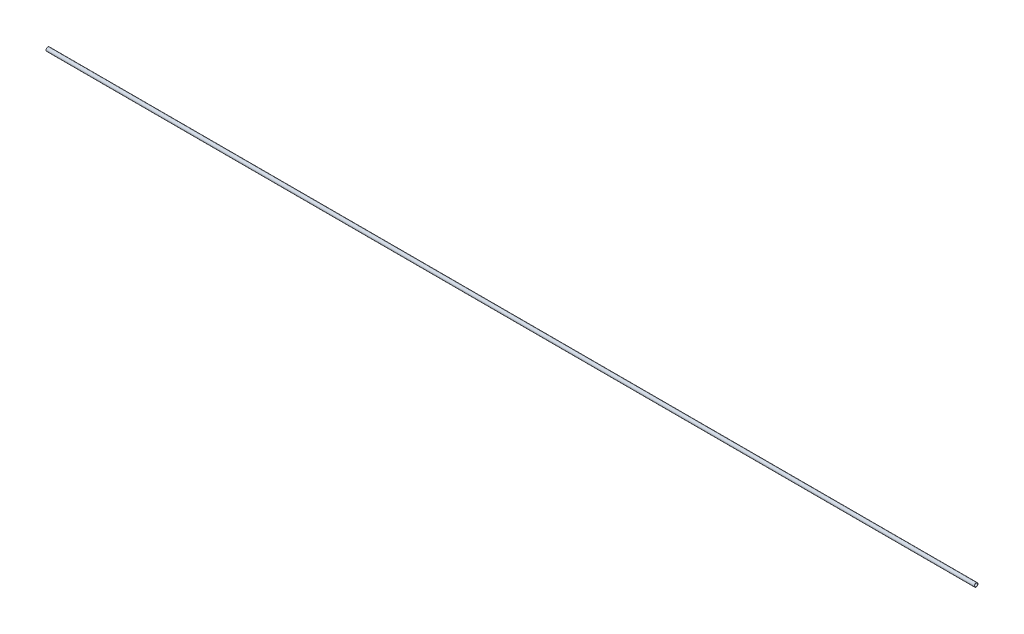
ISO-10303-21;
HEADER;
FILE_DESCRIPTION(('STEP AP214'),'2;1');
FILE_NAME('part.step','',(''),(''),'','','');
FILE_SCHEMA(('AUTOMOTIVE_DESIGN { 1 0 10303 214 1 1 1 1 }'));
ENDSEC;
DATA;
#1=APPLICATION_CONTEXT('core data for automotive mechanical design processes');
#2=APPLICATION_PROTOCOL_DEFINITION('international standard','automotive_design',2000,#1);
#3=PRODUCT_CONTEXT('',#1,'mechanical');
#4=PRODUCT('Part','Part','',(#3));
#5=PRODUCT_RELATED_PRODUCT_CATEGORY('part','',(#4));
#6=PRODUCT_DEFINITION_FORMATION('','',#4);
#7=PRODUCT_DEFINITION_CONTEXT('part definition',#1,'design');
#8=PRODUCT_DEFINITION('design','',#6,#7);
#9=PRODUCT_DEFINITION_SHAPE('','',#8);
#10=(LENGTH_UNIT() NAMED_UNIT(*) SI_UNIT(.MILLI.,.METRE.));
#11=(NAMED_UNIT(*) PLANE_ANGLE_UNIT() SI_UNIT($,.RADIAN.));
#12=(NAMED_UNIT(*) SI_UNIT($,.STERADIAN.) SOLID_ANGLE_UNIT());
#13=UNCERTAINTY_MEASURE_WITH_UNIT(LENGTH_MEASURE(1.E-05),#10,'distance_accuracy_value','');
#14=(GEOMETRIC_REPRESENTATION_CONTEXT(3) GLOBAL_UNCERTAINTY_ASSIGNED_CONTEXT((#13)) GLOBAL_UNIT_ASSIGNED_CONTEXT((#10,
#11,#12)) REPRESENTATION_CONTEXT('',''));
#15=CARTESIAN_POINT('',(0.,0.,0.));
#16=DIRECTION('',(0.,0.,1.));
#17=DIRECTION('',(1.,0.,0.));
#18=AXIS2_PLACEMENT_3D('',#15,#16,#17);
#19=CARTESIAN_POINT('',(0.,0.,0.));
#20=DIRECTION('',(1.,0.,0.));
#21=DIRECTION('',(0.,0.,-1.));
#22=AXIS2_PLACEMENT_3D('',#19,#20,#21);
#23=CYLINDRICAL_SURFACE('',#22,8.1);
#24=CARTESIAN_POINT('',(0.,0.,0.));
#25=DIRECTION('',(1.,0.,0.));
#26=DIRECTION('',(0.,0.,-1.));
#27=AXIS2_PLACEMENT_3D('',#24,#25,#26);
#28=CIRCLE('',#27,8.1);
#29=CARTESIAN_POINT('',(0.,0.,-8.1));
#30=VERTEX_POINT('',#29);
#31=EDGE_CURVE('E16',#30,#30,#28,.T.);
#32=ORIENTED_EDGE('',*,*,#31,.F.);
#33=EDGE_LOOP('',(#32));
#34=FACE_BOUND('',#33,.T.);
#35=CARTESIAN_POINT('',(5000.,0.,0.));
#36=DIRECTION('',(1.,0.,0.));
#37=DIRECTION('',(0.,0.,-1.));
#38=AXIS2_PLACEMENT_3D('',#35,#36,#37);
#39=CIRCLE('',#38,8.1);
#40=CARTESIAN_POINT('',(5000.,0.,-8.1));
#41=VERTEX_POINT('',#40);
#42=EDGE_CURVE('E25',#41,#41,#39,.F.);
#43=ORIENTED_EDGE('',*,*,#42,.F.);
#44=EDGE_LOOP('',(#43));
#45=FACE_BOUND('',#44,.T.);
#46=ADVANCED_FACE('F13',(#34,#45),#23,.F.);
#47=CARTESIAN_POINT('',(0.,-10.1200021082709,-10.));
#48=DIRECTION('',(-1.,0.,0.));
#49=DIRECTION('',(0.,0.,1.));
#50=AXIS2_PLACEMENT_3D('',#47,#48,#49);
#51=PLANE('',#50);
#52=ORIENTED_EDGE('',*,*,#31,.T.);
#53=EDGE_LOOP('',(#52));
#54=FACE_BOUND('',#53,.T.);
#55=CARTESIAN_POINT('',(0.,0.,0.));
#56=DIRECTION('',(1.,0.,0.));
#57=DIRECTION('',(0.,0.,-1.));
#58=AXIS2_PLACEMENT_3D('',#55,#56,#57);
#59=CIRCLE('',#58,10.);
#60=CARTESIAN_POINT('',(0.,0.,-10.));
#61=VERTEX_POINT('',#60);
#62=EDGE_CURVE('E20',#61,#61,#59,.T.);
#63=ORIENTED_EDGE('',*,*,#62,.F.);
#64=EDGE_LOOP('',(#63));
#65=FACE_BOUND('',#64,.T.);
#66=ADVANCED_FACE('F33',(#54,#65),#51,.T.);
#67=CARTESIAN_POINT('',(5000.,-10.1200021082709,10.));
#68=DIRECTION('',(1.,0.,0.));
#69=DIRECTION('',(0.,0.,-1.));
#70=AXIS2_PLACEMENT_3D('',#67,#68,#69);
#71=PLANE('',#70);
#72=ORIENTED_EDGE('',*,*,#42,.T.);
#73=EDGE_LOOP('',(#72));
#74=FACE_BOUND('',#73,.T.);
#75=CARTESIAN_POINT('',(5000.,0.,0.));
#76=DIRECTION('',(1.,0.,0.));
#77=DIRECTION('',(0.,0.,-1.));
#78=AXIS2_PLACEMENT_3D('',#75,#76,#77);
#79=CIRCLE('',#78,10.);
#80=CARTESIAN_POINT('',(5000.,0.,-10.));
#81=VERTEX_POINT('',#80);
#82=EDGE_CURVE('E8',#81,#81,#79,.F.);
#83=ORIENTED_EDGE('',*,*,#82,.F.);
#84=EDGE_LOOP('',(#83));
#85=FACE_BOUND('',#84,.T.);
#86=ADVANCED_FACE('F42',(#74,#85),#71,.T.);
#87=CARTESIAN_POINT('',(5000.,0.,0.));
#88=DIRECTION('',(1.,0.,0.));
#89=DIRECTION('',(0.,0.,-1.));
#90=AXIS2_PLACEMENT_3D('',#87,#88,#89);
#91=CYLINDRICAL_SURFACE('',#90,10.);
#92=ORIENTED_EDGE('',*,*,#62,.T.);
#93=EDGE_LOOP('',(#92));
#94=FACE_BOUND('',#93,.T.);
#95=ORIENTED_EDGE('',*,*,#82,.T.);
#96=EDGE_LOOP('',(#95));
#97=FACE_BOUND('',#96,.T.);
#98=ADVANCED_FACE('F43',(#94,#97),#91,.T.);
#99=CLOSED_SHELL('',(#46,#66,#86,#98));
#100=MANIFOLD_SOLID_BREP('B1',#99);
#101=ADVANCED_BREP_SHAPE_REPRESENTATION('',(#18,#100),#14);
#102=SHAPE_DEFINITION_REPRESENTATION(#9,#101);
ENDSEC;
END-ISO-10303-21;
